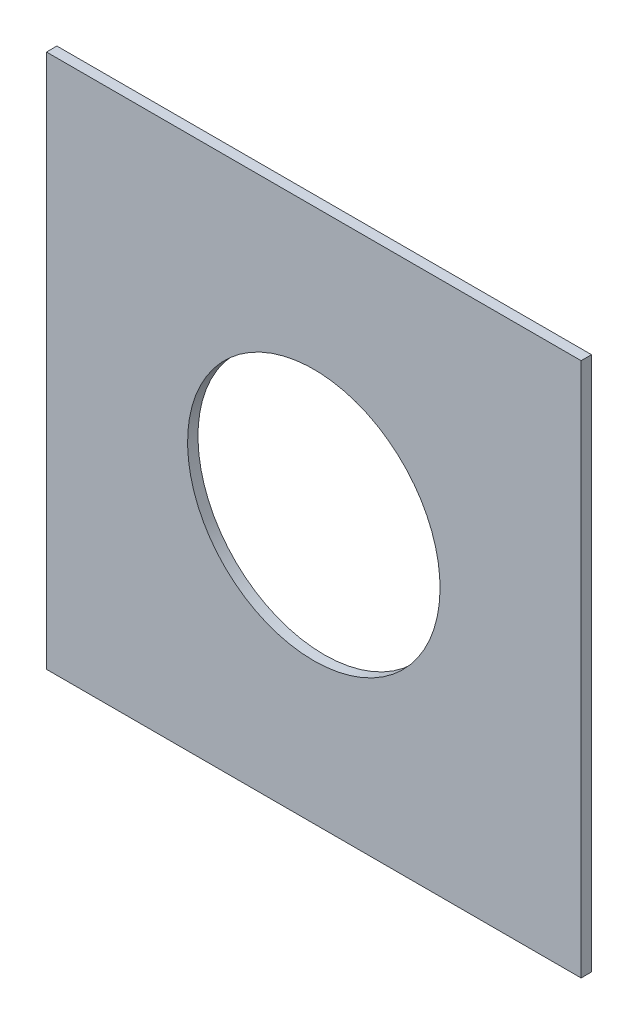
ISO-10303-21;
HEADER;
FILE_DESCRIPTION(('STEP AP214'),'2;1');
FILE_NAME('part.step','',(''),(''),'','','');
FILE_SCHEMA(('AUTOMOTIVE_DESIGN { 1 0 10303 214 1 1 1 1 }'));
ENDSEC;
DATA;
#1=APPLICATION_CONTEXT('core data for automotive mechanical design processes');
#2=APPLICATION_PROTOCOL_DEFINITION('international standard','automotive_design',2000,#1);
#3=PRODUCT_CONTEXT('',#1,'mechanical');
#4=PRODUCT('Part','Part','',(#3));
#5=PRODUCT_RELATED_PRODUCT_CATEGORY('part','',(#4));
#6=PRODUCT_DEFINITION_FORMATION('','',#4);
#7=PRODUCT_DEFINITION_CONTEXT('part definition',#1,'design');
#8=PRODUCT_DEFINITION('design','',#6,#7);
#9=PRODUCT_DEFINITION_SHAPE('','',#8);
#10=(LENGTH_UNIT() NAMED_UNIT(*) SI_UNIT(.MILLI.,.METRE.));
#11=(NAMED_UNIT(*) PLANE_ANGLE_UNIT() SI_UNIT($,.RADIAN.));
#12=(NAMED_UNIT(*) SI_UNIT($,.STERADIAN.) SOLID_ANGLE_UNIT());
#13=UNCERTAINTY_MEASURE_WITH_UNIT(LENGTH_MEASURE(1.E-05),#10,'distance_accuracy_value','');
#14=(GEOMETRIC_REPRESENTATION_CONTEXT(3) GLOBAL_UNCERTAINTY_ASSIGNED_CONTEXT((#13)) GLOBAL_UNIT_ASSIGNED_CONTEXT((#10,
#11,#12)) REPRESENTATION_CONTEXT('',''));
#15=CARTESIAN_POINT('',(0.,0.,0.));
#16=DIRECTION('',(0.,0.,1.));
#17=DIRECTION('',(1.,0.,0.));
#18=AXIS2_PLACEMENT_3D('',#15,#16,#17);
#19=CARTESIAN_POINT('',(119.6898,-71.2108,-0.045));
#20=DIRECTION('',(0.,0.,-1.));
#21=DIRECTION('',(0.,-1.,0.));
#22=AXIS2_PLACEMENT_3D('',#19,#20,#21);
#23=CYLINDRICAL_SURFACE('',#22,0.425);
#24=CARTESIAN_POINT('',(119.6898,-71.2108,1.67));
#25=DIRECTION('',(0.,0.,-1.));
#26=DIRECTION('',(0.,-1.,0.));
#27=AXIS2_PLACEMENT_3D('',#24,#25,#26);
#28=CIRCLE('',#27,0.425);
#29=CARTESIAN_POINT('',(119.6898,-71.6358,1.67));
#30=VERTEX_POINT('',#29);
#31=EDGE_CURVE('E80',#30,#30,#28,.T.);
#32=ORIENTED_EDGE('',*,*,#31,.T.);
#33=DIRECTION('',(0.,0.,1.));
#34=VECTOR('',#33,1.);
#35=CARTESIAN_POINT('',(119.6898,-71.6358,-0.045));
#36=LINE('',#35,#34);
#37=CARTESIAN_POINT('',(119.6898,-71.6358,1.705));
#38=VERTEX_POINT('',#37);
#39=EDGE_CURVE('E11',#30,#38,#36,.T.);
#40=ORIENTED_EDGE('',*,*,#39,.T.);
#41=CARTESIAN_POINT('',(119.6898,-71.2108,1.705));
#42=DIRECTION('',(0.,0.,-1.));
#43=DIRECTION('',(0.,-1.,0.));
#44=AXIS2_PLACEMENT_3D('',#41,#42,#43);
#45=CIRCLE('',#44,0.425);
#46=EDGE_CURVE('E20',#38,#38,#45,.T.);
#47=ORIENTED_EDGE('',*,*,#46,.F.);
#48=ORIENTED_EDGE('',*,*,#39,.F.);
#49=EDGE_LOOP('',(#32,#40,#47,#48));
#50=FACE_BOUND('',#49,.T.);
#51=ADVANCED_FACE('F17',(#50),#23,.F.);
#52=CARTESIAN_POINT('',(118.7898,-70.3108,1.67));
#53=DIRECTION('',(0.,1.,0.));
#54=DIRECTION('',(1.,0.,0.));
#55=AXIS2_PLACEMENT_3D('',#52,#53,#54);
#56=PLANE('',#55);
#57=DIRECTION('',(0.,0.,1.));
#58=VECTOR('',#57,1.);
#59=CARTESIAN_POINT('',(118.7898,-70.3108,1.67));
#60=LINE('',#59,#58);
#61=CARTESIAN_POINT('',(118.7898,-70.3108,1.67));
#62=VERTEX_POINT('',#61);
#63=CARTESIAN_POINT('',(118.7898,-70.3108,1.705));
#64=VERTEX_POINT('',#63);
#65=EDGE_CURVE('E82',#62,#64,#60,.T.);
#66=ORIENTED_EDGE('',*,*,#65,.T.);
#67=DIRECTION('',(1.,0.,0.));
#68=VECTOR('',#67,1.);
#69=CARTESIAN_POINT('',(118.7898,-70.3108,1.705));
#70=LINE('',#69,#68);
#71=CARTESIAN_POINT('',(120.5898,-70.3108,1.705));
#72=VERTEX_POINT('',#71);
#73=EDGE_CURVE('E67',#64,#72,#70,.T.);
#74=ORIENTED_EDGE('',*,*,#73,.T.);
#75=DIRECTION('',(0.,0.,1.));
#76=VECTOR('',#75,1.);
#77=CARTESIAN_POINT('',(120.5898,-70.3108,1.67));
#78=LINE('',#77,#76);
#79=CARTESIAN_POINT('',(120.5898,-70.3108,1.67));
#80=VERTEX_POINT('',#79);
#81=EDGE_CURVE('E104',#80,#72,#78,.T.);
#82=ORIENTED_EDGE('',*,*,#81,.F.);
#83=DIRECTION('',(1.,0.,0.));
#84=VECTOR('',#83,1.);
#85=CARTESIAN_POINT('',(118.7898,-70.3108,1.67));
#86=LINE('',#85,#84);
#87=EDGE_CURVE('E84',#62,#80,#86,.T.);
#88=ORIENTED_EDGE('',*,*,#87,.F.);
#89=EDGE_LOOP('',(#66,#74,#82,#88));
#90=FACE_BOUND('',#89,.T.);
#91=ADVANCED_FACE('F83',(#90),#56,.T.);
#92=CARTESIAN_POINT('',(0.,0.,1.705));
#93=DIRECTION('',(0.,0.,1.));
#94=DIRECTION('',(1.,0.,0.));
#95=AXIS2_PLACEMENT_3D('',#92,#93,#94);
#96=PLANE('',#95);
#97=ORIENTED_EDGE('',*,*,#46,.T.);
#98=EDGE_LOOP('',(#97));
#99=FACE_BOUND('',#98,.T.);
#100=DIRECTION('',(-1.,0.,0.));
#101=VECTOR('',#100,1.);
#102=CARTESIAN_POINT('',(120.5898,-72.1108,1.705));
#103=LINE('',#102,#101);
#104=CARTESIAN_POINT('',(120.5898,-72.1108,1.705));
#105=VERTEX_POINT('',#104);
#106=CARTESIAN_POINT('',(118.7898,-72.1108,1.705));
#107=VERTEX_POINT('',#106);
#108=EDGE_CURVE('E131',#105,#107,#103,.T.);
#109=ORIENTED_EDGE('',*,*,#108,.F.);
#110=DIRECTION('',(0.,-1.,0.));
#111=VECTOR('',#110,1.);
#112=CARTESIAN_POINT('',(120.5898,-70.3108,1.705));
#113=LINE('',#112,#111);
#114=EDGE_CURVE('E75',#72,#105,#113,.T.);
#115=ORIENTED_EDGE('',*,*,#114,.F.);
#116=ORIENTED_EDGE('',*,*,#73,.F.);
#117=DIRECTION('',(0.,1.,0.));
#118=VECTOR('',#117,1.);
#119=CARTESIAN_POINT('',(118.7898,-72.1108,1.705));
#120=LINE('',#119,#118);
#121=EDGE_CURVE('E72',#107,#64,#120,.T.);
#122=ORIENTED_EDGE('',*,*,#121,.F.);
#123=EDGE_LOOP('',(#109,#115,#116,#122));
#124=FACE_BOUND('',#123,.T.);
#125=ADVANCED_FACE('F70',(#99,#124),#96,.T.);
#126=CARTESIAN_POINT('',(0.,0.,1.67));
#127=DIRECTION('',(0.,0.,1.));
#128=DIRECTION('',(1.,0.,0.));
#129=AXIS2_PLACEMENT_3D('',#126,#127,#128);
#130=PLANE('',#129);
#131=ORIENTED_EDGE('',*,*,#31,.F.);
#132=EDGE_LOOP('',(#131));
#133=FACE_BOUND('',#132,.T.);
#134=DIRECTION('',(0.,1.,0.));
#135=VECTOR('',#134,1.);
#136=CARTESIAN_POINT('',(118.7898,-72.1108,1.67));
#137=LINE('',#136,#135);
#138=CARTESIAN_POINT('',(118.7898,-72.1108,1.67));
#139=VERTEX_POINT('',#138);
#140=EDGE_CURVE('E88',#139,#62,#137,.T.);
#141=ORIENTED_EDGE('',*,*,#140,.T.);
#142=ORIENTED_EDGE('',*,*,#87,.T.);
#143=DIRECTION('',(0.,-1.,0.));
#144=VECTOR('',#143,1.);
#145=CARTESIAN_POINT('',(120.5898,-70.3108,1.67));
#146=LINE('',#145,#144);
#147=CARTESIAN_POINT('',(120.5898,-72.1108,1.67));
#148=VERTEX_POINT('',#147);
#149=EDGE_CURVE('E95',#80,#148,#146,.T.);
#150=ORIENTED_EDGE('',*,*,#149,.T.);
#151=DIRECTION('',(-1.,0.,0.));
#152=VECTOR('',#151,1.);
#153=CARTESIAN_POINT('',(120.5898,-72.1108,1.67));
#154=LINE('',#153,#152);
#155=EDGE_CURVE('E123',#148,#139,#154,.T.);
#156=ORIENTED_EDGE('',*,*,#155,.T.);
#157=EDGE_LOOP('',(#141,#142,#150,#156));
#158=FACE_BOUND('',#157,.T.);
#159=ADVANCED_FACE('F116',(#133,#158),#130,.F.);
#160=CARTESIAN_POINT('',(118.7898,-72.1108,1.67));
#161=DIRECTION('',(-1.,0.,0.));
#162=DIRECTION('',(0.,0.,1.));
#163=AXIS2_PLACEMENT_3D('',#160,#161,#162);
#164=PLANE('',#163);
#165=DIRECTION('',(0.,0.,1.));
#166=VECTOR('',#165,1.);
#167=CARTESIAN_POINT('',(118.7898,-72.1108,1.67));
#168=LINE('',#167,#166);
#169=EDGE_CURVE('E92',#139,#107,#168,.T.);
#170=ORIENTED_EDGE('',*,*,#169,.T.);
#171=ORIENTED_EDGE('',*,*,#121,.T.);
#172=ORIENTED_EDGE('',*,*,#65,.F.);
#173=ORIENTED_EDGE('',*,*,#140,.F.);
#174=EDGE_LOOP('',(#170,#171,#172,#173));
#175=FACE_BOUND('',#174,.T.);
#176=ADVANCED_FACE('F90',(#175),#164,.T.);
#177=CARTESIAN_POINT('',(120.5898,-70.3108,1.67));
#178=DIRECTION('',(1.,0.,0.));
#179=DIRECTION('',(0.,1.,0.));
#180=AXIS2_PLACEMENT_3D('',#177,#178,#179);
#181=PLANE('',#180);
#182=ORIENTED_EDGE('',*,*,#81,.T.);
#183=ORIENTED_EDGE('',*,*,#114,.T.);
#184=DIRECTION('',(0.,0.,1.));
#185=VECTOR('',#184,1.);
#186=CARTESIAN_POINT('',(120.5898,-72.1108,1.67));
#187=LINE('',#186,#185);
#188=EDGE_CURVE('E137',#148,#105,#187,.T.);
#189=ORIENTED_EDGE('',*,*,#188,.F.);
#190=ORIENTED_EDGE('',*,*,#149,.F.);
#191=EDGE_LOOP('',(#182,#183,#189,#190));
#192=FACE_BOUND('',#191,.T.);
#193=ADVANCED_FACE('F147',(#192),#181,.T.);
#194=CARTESIAN_POINT('',(120.5898,-72.1108,1.67));
#195=DIRECTION('',(0.,-1.,0.));
#196=DIRECTION('',(0.,0.,-1.));
#197=AXIS2_PLACEMENT_3D('',#194,#195,#196);
#198=PLANE('',#197);
#199=ORIENTED_EDGE('',*,*,#188,.T.);
#200=ORIENTED_EDGE('',*,*,#108,.T.);
#201=ORIENTED_EDGE('',*,*,#169,.F.);
#202=ORIENTED_EDGE('',*,*,#155,.F.);
#203=EDGE_LOOP('',(#199,#200,#201,#202));
#204=FACE_BOUND('',#203,.T.);
#205=ADVANCED_FACE('F130',(#204),#198,.T.);
#206=CLOSED_SHELL('',(#51,#91,#125,#159,#176,#193,#205));
#207=MANIFOLD_SOLID_BREP('B1',#206);
#208=ADVANCED_BREP_SHAPE_REPRESENTATION('',(#18,#207),#14);
#209=SHAPE_DEFINITION_REPRESENTATION(#9,#208);
ENDSEC;
END-ISO-10303-21;
